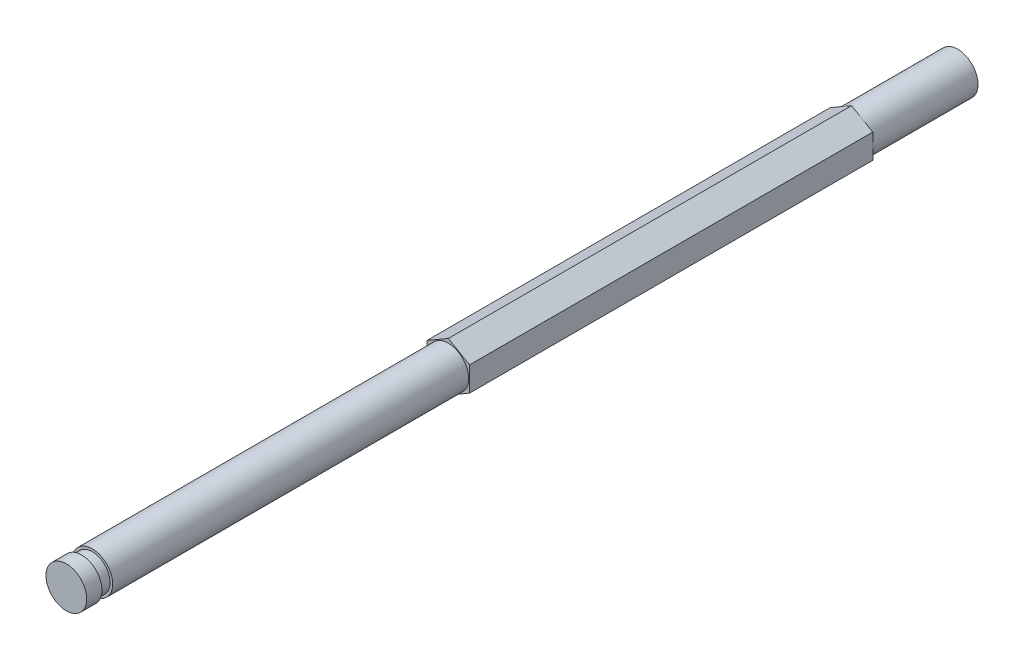
ISO-10303-21;
HEADER;
FILE_DESCRIPTION(('STEP AP214'),'2;1');
FILE_NAME('part.step','',(''),(''),'','','');
FILE_SCHEMA(('AUTOMOTIVE_DESIGN { 1 0 10303 214 1 1 1 1 }'));
ENDSEC;
DATA;
#1=APPLICATION_CONTEXT('core data for automotive mechanical design processes');
#2=APPLICATION_PROTOCOL_DEFINITION('international standard','automotive_design',2000,#1);
#3=PRODUCT_CONTEXT('',#1,'mechanical');
#4=PRODUCT('Part','Part','',(#3));
#5=PRODUCT_RELATED_PRODUCT_CATEGORY('part','',(#4));
#6=PRODUCT_DEFINITION_FORMATION('','',#4);
#7=PRODUCT_DEFINITION_CONTEXT('part definition',#1,'design');
#8=PRODUCT_DEFINITION('design','',#6,#7);
#9=PRODUCT_DEFINITION_SHAPE('','',#8);
#10=(LENGTH_UNIT() NAMED_UNIT(*) SI_UNIT(.MILLI.,.METRE.));
#11=(NAMED_UNIT(*) PLANE_ANGLE_UNIT() SI_UNIT($,.RADIAN.));
#12=(NAMED_UNIT(*) SI_UNIT($,.STERADIAN.) SOLID_ANGLE_UNIT());
#13=UNCERTAINTY_MEASURE_WITH_UNIT(LENGTH_MEASURE(1.E-05),#10,'distance_accuracy_value','');
#14=(GEOMETRIC_REPRESENTATION_CONTEXT(3) GLOBAL_UNCERTAINTY_ASSIGNED_CONTEXT((#13)) GLOBAL_UNIT_ASSIGNED_CONTEXT((#10,
#11,#12)) REPRESENTATION_CONTEXT('',''));
#15=CARTESIAN_POINT('',(0.,0.,0.));
#16=DIRECTION('',(0.,0.,1.));
#17=DIRECTION('',(1.,0.,0.));
#18=AXIS2_PLACEMENT_3D('',#15,#16,#17);
#19=CARTESIAN_POINT('',(0.,0.,76.2));
#20=DIRECTION('',(0.,0.,1.));
#21=DIRECTION('',(1.,0.,0.));
#22=AXIS2_PLACEMENT_3D('',#19,#20,#21);
#23=CYLINDRICAL_SURFACE('',#22,3.048);
#24=CARTESIAN_POINT('',(0.,0.,76.2));
#25=DIRECTION('',(0.,0.,1.));
#26=DIRECTION('',(1.,0.,0.));
#27=AXIS2_PLACEMENT_3D('',#24,#25,#26);
#28=CIRCLE('',#27,3.048);
#29=CARTESIAN_POINT('',(3.048,0.,76.2));
#30=VERTEX_POINT('',#29);
#31=EDGE_CURVE('E149',#30,#30,#28,.T.);
#32=ORIENTED_EDGE('',*,*,#31,.T.);
#33=EDGE_LOOP('',(#32));
#34=FACE_BOUND('',#33,.T.);
#35=CARTESIAN_POINT('',(0.,0.,129.4638));
#36=DIRECTION('',(0.,0.,1.));
#37=DIRECTION('',(1.,0.,0.));
#38=AXIS2_PLACEMENT_3D('',#35,#36,#37);
#39=CIRCLE('',#38,3.048);
#40=CARTESIAN_POINT('',(3.048,0.,129.4638));
#41=VERTEX_POINT('',#40);
#42=EDGE_CURVE('E41',#41,#41,#39,.F.);
#43=ORIENTED_EDGE('',*,*,#42,.T.);
#44=EDGE_LOOP('',(#43));
#45=FACE_BOUND('',#44,.T.);
#46=ADVANCED_FACE('F37',(#34,#45),#23,.T.);
#47=CARTESIAN_POINT('',(3.175,1.83308710467706,133.35));
#48=DIRECTION('',(-0.5,-0.866025403784439,0.));
#49=DIRECTION('',(0.866025403784439,-0.5,0.));
#50=AXIS2_PLACEMENT_3D('',#47,#48,#49);
#51=PLANE('',#50);
#52=DIRECTION('',(0.866025403784439,-0.5,0.));
#53=VECTOR('',#52,1.);
#54=CARTESIAN_POINT('',(3.175,1.83308710467706,15.875));
#55=LINE('',#54,#53);
#56=CARTESIAN_POINT('',(0.,3.66617420935412,15.875));
#57=VERTEX_POINT('',#56);
#58=CARTESIAN_POINT('',(3.175,1.83308710467706,15.875));
#59=VERTEX_POINT('',#58);
#60=EDGE_CURVE('E53',#57,#59,#55,.T.);
#61=ORIENTED_EDGE('',*,*,#60,.F.);
#62=DIRECTION('',(0.,0.,-1.));
#63=VECTOR('',#62,1.);
#64=CARTESIAN_POINT('',(0.,3.66617420935412,133.35));
#65=LINE('',#64,#63);
#66=CARTESIAN_POINT('',(0.,3.66617420935412,76.2));
#67=VERTEX_POINT('',#66);
#68=EDGE_CURVE('E120',#67,#57,#65,.T.);
#69=ORIENTED_EDGE('',*,*,#68,.F.);
#70=DIRECTION('',(-0.866025403784439,0.5,0.));
#71=VECTOR('',#70,1.);
#72=CARTESIAN_POINT('',(3.175,1.83308710467706,76.2));
#73=LINE('',#72,#71);
#74=CARTESIAN_POINT('',(3.175,1.83308710467706,76.2));
#75=VERTEX_POINT('',#74);
#76=EDGE_CURVE('E111',#75,#67,#73,.T.);
#77=ORIENTED_EDGE('',*,*,#76,.F.);
#78=DIRECTION('',(0.,0.,-1.));
#79=VECTOR('',#78,1.);
#80=CARTESIAN_POINT('',(3.175,1.83308710467706,133.35));
#81=LINE('',#80,#79);
#82=EDGE_CURVE('E107',#75,#59,#81,.T.);
#83=ORIENTED_EDGE('',*,*,#82,.T.);
#84=EDGE_LOOP('',(#61,#69,#77,#83));
#85=FACE_BOUND('',#84,.T.);
#86=ADVANCED_FACE('F39',(#85),#51,.F.);
#87=CARTESIAN_POINT('',(0.,3.66617420935412,133.35));
#88=DIRECTION('',(0.5,-0.866025403784439,0.));
#89=DIRECTION('',(0.866025403784439,0.5,0.));
#90=AXIS2_PLACEMENT_3D('',#87,#88,#89);
#91=PLANE('',#90);
#92=DIRECTION('',(0.866025403784439,0.5,0.));
#93=VECTOR('',#92,1.);
#94=CARTESIAN_POINT('',(0.,3.66617420935412,15.875));
#95=LINE('',#94,#93);
#96=CARTESIAN_POINT('',(-3.175,1.83308710467706,15.875));
#97=VERTEX_POINT('',#96);
#98=EDGE_CURVE('E145',#97,#57,#95,.T.);
#99=ORIENTED_EDGE('',*,*,#98,.F.);
#100=DIRECTION('',(0.,0.,-1.));
#101=VECTOR('',#100,1.);
#102=CARTESIAN_POINT('',(-3.175,1.83308710467706,133.35));
#103=LINE('',#102,#101);
#104=CARTESIAN_POINT('',(-3.175,1.83308710467706,76.2));
#105=VERTEX_POINT('',#104);
#106=EDGE_CURVE('E117',#105,#97,#103,.T.);
#107=ORIENTED_EDGE('',*,*,#106,.F.);
#108=DIRECTION('',(-0.866025403784439,-0.5,0.));
#109=VECTOR('',#108,1.);
#110=CARTESIAN_POINT('',(0.,3.66617420935412,76.2));
#111=LINE('',#110,#109);
#112=EDGE_CURVE('E159',#67,#105,#111,.T.);
#113=ORIENTED_EDGE('',*,*,#112,.F.);
#114=ORIENTED_EDGE('',*,*,#68,.T.);
#115=EDGE_LOOP('',(#99,#107,#113,#114));
#116=FACE_BOUND('',#115,.T.);
#117=ADVANCED_FACE('F169',(#116),#91,.F.);
#118=CARTESIAN_POINT('',(-3.175,1.83308710467706,133.35));
#119=DIRECTION('',(1.,0.,0.));
#120=DIRECTION('',(0.,1.,0.));
#121=AXIS2_PLACEMENT_3D('',#118,#119,#120);
#122=PLANE('',#121);
#123=DIRECTION('',(0.,1.,0.));
#124=VECTOR('',#123,1.);
#125=CARTESIAN_POINT('',(-3.175,1.83308710467706,15.875));
#126=LINE('',#125,#124);
#127=CARTESIAN_POINT('',(-3.175,-1.83308710467706,15.875));
#128=VERTEX_POINT('',#127);
#129=EDGE_CURVE('E143',#128,#97,#126,.T.);
#130=ORIENTED_EDGE('',*,*,#129,.F.);
#131=DIRECTION('',(0.,0.,-1.));
#132=VECTOR('',#131,1.);
#133=CARTESIAN_POINT('',(-3.175,-1.83308710467706,133.35));
#134=LINE('',#133,#132);
#135=CARTESIAN_POINT('',(-3.175,-1.83308710467706,76.2));
#136=VERTEX_POINT('',#135);
#137=EDGE_CURVE('E109',#136,#128,#134,.T.);
#138=ORIENTED_EDGE('',*,*,#137,.F.);
#139=DIRECTION('',(0.,-1.,0.));
#140=VECTOR('',#139,1.);
#141=CARTESIAN_POINT('',(-3.175,1.83308710467706,76.2));
#142=LINE('',#141,#140);
#143=EDGE_CURVE('E157',#105,#136,#142,.T.);
#144=ORIENTED_EDGE('',*,*,#143,.F.);
#145=ORIENTED_EDGE('',*,*,#106,.T.);
#146=EDGE_LOOP('',(#130,#138,#144,#145));
#147=FACE_BOUND('',#146,.T.);
#148=ADVANCED_FACE('F175',(#147),#122,.F.);
#149=CARTESIAN_POINT('',(-3.175,-1.83308710467706,133.35));
#150=DIRECTION('',(0.5,0.866025403784439,0.));
#151=DIRECTION('',(-0.866025403784439,0.5,0.));
#152=AXIS2_PLACEMENT_3D('',#149,#150,#151);
#153=PLANE('',#152);
#154=DIRECTION('',(-0.866025403784439,0.5,0.));
#155=VECTOR('',#154,1.);
#156=CARTESIAN_POINT('',(-3.175,-1.83308710467706,15.875));
#157=LINE('',#156,#155);
#158=CARTESIAN_POINT('',(0.,-3.66617420935412,15.875));
#159=VERTEX_POINT('',#158);
#160=EDGE_CURVE('E103',#159,#128,#157,.T.);
#161=ORIENTED_EDGE('',*,*,#160,.F.);
#162=DIRECTION('',(0.,0.,-1.));
#163=VECTOR('',#162,1.);
#164=CARTESIAN_POINT('',(0.,-3.66617420935412,133.35));
#165=LINE('',#164,#163);
#166=CARTESIAN_POINT('',(0.,-3.66617420935412,76.2));
#167=VERTEX_POINT('',#166);
#168=EDGE_CURVE('E102',#167,#159,#165,.T.);
#169=ORIENTED_EDGE('',*,*,#168,.F.);
#170=DIRECTION('',(0.866025403784439,-0.5,0.));
#171=VECTOR('',#170,1.);
#172=CARTESIAN_POINT('',(-3.175,-1.83308710467706,76.2));
#173=LINE('',#172,#171);
#174=EDGE_CURVE('E155',#136,#167,#173,.T.);
#175=ORIENTED_EDGE('',*,*,#174,.F.);
#176=ORIENTED_EDGE('',*,*,#137,.T.);
#177=EDGE_LOOP('',(#161,#169,#175,#176));
#178=FACE_BOUND('',#177,.T.);
#179=ADVANCED_FACE('F211',(#178),#153,.F.);
#180=CARTESIAN_POINT('',(0.,-3.66617420935412,133.35));
#181=DIRECTION('',(-0.5,0.866025403784439,0.));
#182=DIRECTION('',(-0.866025403784439,-0.5,0.));
#183=AXIS2_PLACEMENT_3D('',#180,#181,#182);
#184=PLANE('',#183);
#185=DIRECTION('',(-0.866025403784439,-0.5,0.));
#186=VECTOR('',#185,1.);
#187=CARTESIAN_POINT('',(0.,-3.66617420935412,15.875));
#188=LINE('',#187,#186);
#189=CARTESIAN_POINT('',(3.175,-1.83308710467706,15.875));
#190=VERTEX_POINT('',#189);
#191=EDGE_CURVE('E90',#190,#159,#188,.T.);
#192=ORIENTED_EDGE('',*,*,#191,.F.);
#193=DIRECTION('',(0.,0.,-1.));
#194=VECTOR('',#193,1.);
#195=CARTESIAN_POINT('',(3.175,-1.83308710467706,133.35));
#196=LINE('',#195,#194);
#197=CARTESIAN_POINT('',(3.175,-1.83308710467706,76.2));
#198=VERTEX_POINT('',#197);
#199=EDGE_CURVE('E100',#198,#190,#196,.T.);
#200=ORIENTED_EDGE('',*,*,#199,.F.);
#201=DIRECTION('',(0.866025403784439,0.5,0.));
#202=VECTOR('',#201,1.);
#203=CARTESIAN_POINT('',(0.,-3.66617420935412,76.2));
#204=LINE('',#203,#202);
#205=EDGE_CURVE('E61',#167,#198,#204,.T.);
#206=ORIENTED_EDGE('',*,*,#205,.F.);
#207=ORIENTED_EDGE('',*,*,#168,.T.);
#208=EDGE_LOOP('',(#192,#200,#206,#207));
#209=FACE_BOUND('',#208,.T.);
#210=ADVANCED_FACE('F99',(#209),#184,.F.);
#211=CARTESIAN_POINT('',(3.175,-1.83308710467706,133.35));
#212=DIRECTION('',(-1.,0.,0.));
#213=DIRECTION('',(0.,-1.,0.));
#214=AXIS2_PLACEMENT_3D('',#211,#212,#213);
#215=PLANE('',#214);
#216=DIRECTION('',(0.,-1.,0.));
#217=VECTOR('',#216,1.);
#218=CARTESIAN_POINT('',(3.175,-1.83308710467706,15.875));
#219=LINE('',#218,#217);
#220=EDGE_CURVE('E12',#59,#190,#219,.T.);
#221=ORIENTED_EDGE('',*,*,#220,.F.);
#222=ORIENTED_EDGE('',*,*,#82,.F.);
#223=DIRECTION('',(0.,1.,0.));
#224=VECTOR('',#223,1.);
#225=CARTESIAN_POINT('',(3.175,-1.83308710467706,76.2));
#226=LINE('',#225,#224);
#227=EDGE_CURVE('E46',#198,#75,#226,.T.);
#228=ORIENTED_EDGE('',*,*,#227,.F.);
#229=ORIENTED_EDGE('',*,*,#199,.T.);
#230=EDGE_LOOP('',(#221,#222,#228,#229));
#231=FACE_BOUND('',#230,.T.);
#232=ADVANCED_FACE('F106',(#231),#215,.F.);
#233=CARTESIAN_POINT('',(0.,0.,76.2));
#234=DIRECTION('',(0.,0.,1.));
#235=DIRECTION('',(1.,0.,0.));
#236=AXIS2_PLACEMENT_3D('',#233,#234,#235);
#237=PLANE('',#236);
#238=ORIENTED_EDGE('',*,*,#31,.F.);
#239=EDGE_LOOP('',(#238));
#240=FACE_BOUND('',#239,.T.);
#241=ORIENTED_EDGE('',*,*,#76,.T.);
#242=ORIENTED_EDGE('',*,*,#112,.T.);
#243=ORIENTED_EDGE('',*,*,#143,.T.);
#244=ORIENTED_EDGE('',*,*,#174,.T.);
#245=ORIENTED_EDGE('',*,*,#205,.T.);
#246=ORIENTED_EDGE('',*,*,#227,.T.);
#247=EDGE_LOOP('',(#241,#242,#243,#244,#245,#246));
#248=FACE_BOUND('',#247,.T.);
#249=ADVANCED_FACE('F162',(#240,#248),#237,.T.);
#250=CARTESIAN_POINT('',(0.,0.,15.875));
#251=DIRECTION('',(0.,0.,-1.));
#252=DIRECTION('',(-1.,0.,0.));
#253=AXIS2_PLACEMENT_3D('',#250,#251,#252);
#254=PLANE('',#253);
#255=CARTESIAN_POINT('',(0.,0.,15.875));
#256=DIRECTION('',(0.,0.,-1.));
#257=DIRECTION('',(-1.,0.,0.));
#258=AXIS2_PLACEMENT_3D('',#255,#256,#257);
#259=CIRCLE('',#258,3.048);
#260=CARTESIAN_POINT('',(-3.048,0.,15.875));
#261=VERTEX_POINT('',#260);
#262=EDGE_CURVE('E104',#261,#261,#259,.T.);
#263=ORIENTED_EDGE('',*,*,#262,.F.);
#264=EDGE_LOOP('',(#263));
#265=FACE_BOUND('',#264,.T.);
#266=ORIENTED_EDGE('',*,*,#60,.T.);
#267=ORIENTED_EDGE('',*,*,#220,.T.);
#268=ORIENTED_EDGE('',*,*,#191,.T.);
#269=ORIENTED_EDGE('',*,*,#160,.T.);
#270=ORIENTED_EDGE('',*,*,#129,.T.);
#271=ORIENTED_EDGE('',*,*,#98,.T.);
#272=EDGE_LOOP('',(#266,#267,#268,#269,#270,#271));
#273=FACE_BOUND('',#272,.T.);
#274=ADVANCED_FACE('F89',(#265,#273),#254,.T.);
#275=CARTESIAN_POINT('',(0.,0.,15.875));
#276=DIRECTION('',(0.,0.,-1.));
#277=DIRECTION('',(-1.,0.,0.));
#278=AXIS2_PLACEMENT_3D('',#275,#276,#277);
#279=CYLINDRICAL_SURFACE('',#278,3.048);
#280=ORIENTED_EDGE('',*,*,#262,.T.);
#281=EDGE_LOOP('',(#280));
#282=FACE_BOUND('',#281,.T.);
#283=CARTESIAN_POINT('',(0.,0.,0.));
#284=DIRECTION('',(0.,0.,-1.));
#285=DIRECTION('',(-1.,0.,0.));
#286=AXIS2_PLACEMENT_3D('',#283,#284,#285);
#287=CIRCLE('',#286,3.048);
#288=CARTESIAN_POINT('',(-3.048,0.,0.));
#289=VERTEX_POINT('',#288);
#290=EDGE_CURVE('E129',#289,#289,#287,.T.);
#291=ORIENTED_EDGE('',*,*,#290,.F.);
#292=EDGE_LOOP('',(#291));
#293=FACE_BOUND('',#292,.T.);
#294=ADVANCED_FACE('F205',(#282,#293),#279,.T.);
#295=CARTESIAN_POINT('',(0.,0.,0.));
#296=DIRECTION('',(0.,0.,1.));
#297=DIRECTION('',(1.,0.,0.));
#298=AXIS2_PLACEMENT_3D('',#295,#296,#297);
#299=PLANE('',#298);
#300=ORIENTED_EDGE('',*,*,#290,.T.);
#301=EDGE_LOOP('',(#300));
#302=FACE_BOUND('',#301,.T.);
#303=ADVANCED_FACE('F201',(#302),#299,.F.);
#304=CARTESIAN_POINT('',(0.,0.,129.4638));
#305=DIRECTION('',(0.,0.,1.));
#306=DIRECTION('',(1.,0.,0.));
#307=AXIS2_PLACEMENT_3D('',#304,#305,#306);
#308=PLANE('',#307);
#309=ORIENTED_EDGE('',*,*,#42,.F.);
#310=EDGE_LOOP('',(#309));
#311=FACE_BOUND('',#310,.T.);
#312=CARTESIAN_POINT('',(0.,0.,129.4638));
#313=DIRECTION('',(0.,0.,1.));
#314=DIRECTION('',(1.,0.,0.));
#315=AXIS2_PLACEMENT_3D('',#312,#313,#314);
#316=CIRCLE('',#315,2.667);
#317=CARTESIAN_POINT('',(2.667,0.,129.4638));
#318=VERTEX_POINT('',#317);
#319=EDGE_CURVE('E125',#318,#318,#316,.T.);
#320=ORIENTED_EDGE('',*,*,#319,.F.);
#321=EDGE_LOOP('',(#320));
#322=FACE_BOUND('',#321,.T.);
#323=ADVANCED_FACE('F204',(#311,#322),#308,.T.);
#324=CARTESIAN_POINT('',(0.,0.,131.064));
#325=DIRECTION('',(0.,0.,1.));
#326=DIRECTION('',(1.,0.,0.));
#327=AXIS2_PLACEMENT_3D('',#324,#325,#326);
#328=PLANE('',#327);
#329=CARTESIAN_POINT('',(0.,0.,131.064));
#330=DIRECTION('',(0.,0.,1.));
#331=DIRECTION('',(1.,0.,0.));
#332=AXIS2_PLACEMENT_3D('',#329,#330,#331);
#333=CIRCLE('',#332,3.048);
#334=CARTESIAN_POINT('',(3.048,0.,131.064));
#335=VERTEX_POINT('',#334);
#336=EDGE_CURVE('E123',#335,#335,#333,.F.);
#337=ORIENTED_EDGE('',*,*,#336,.T.);
#338=EDGE_LOOP('',(#337));
#339=FACE_BOUND('',#338,.T.);
#340=CARTESIAN_POINT('',(0.,0.,131.064));
#341=DIRECTION('',(0.,0.,1.));
#342=DIRECTION('',(1.,0.,0.));
#343=AXIS2_PLACEMENT_3D('',#340,#341,#342);
#344=CIRCLE('',#343,2.667);
#345=CARTESIAN_POINT('',(2.667,0.,131.064));
#346=VERTEX_POINT('',#345);
#347=EDGE_CURVE('E131',#346,#346,#344,.T.);
#348=ORIENTED_EDGE('',*,*,#347,.T.);
#349=EDGE_LOOP('',(#348));
#350=FACE_BOUND('',#349,.T.);
#351=ADVANCED_FACE('F198',(#339,#350),#328,.F.);
#352=CARTESIAN_POINT('',(0.,0.,129.4638));
#353=DIRECTION('',(0.,0.,1.));
#354=DIRECTION('',(1.,0.,0.));
#355=AXIS2_PLACEMENT_3D('',#352,#353,#354);
#356=CYLINDRICAL_SURFACE('',#355,2.667);
#357=ORIENTED_EDGE('',*,*,#319,.T.);
#358=EDGE_LOOP('',(#357));
#359=FACE_BOUND('',#358,.T.);
#360=ORIENTED_EDGE('',*,*,#347,.F.);
#361=EDGE_LOOP('',(#360));
#362=FACE_BOUND('',#361,.T.);
#363=ADVANCED_FACE('F190',(#359,#362),#356,.T.);
#364=CARTESIAN_POINT('',(0.,0.,133.35));
#365=DIRECTION('',(0.,0.,1.));
#366=DIRECTION('',(1.,0.,0.));
#367=AXIS2_PLACEMENT_3D('',#364,#365,#366);
#368=PLANE('',#367);
#369=CARTESIAN_POINT('',(0.,0.,133.35));
#370=DIRECTION('',(0.,0.,1.));
#371=DIRECTION('',(1.,0.,0.));
#372=AXIS2_PLACEMENT_3D('',#369,#370,#371);
#373=CIRCLE('',#372,3.048);
#374=CARTESIAN_POINT('',(3.048,0.,133.35));
#375=VERTEX_POINT('',#374);
#376=EDGE_CURVE('E148',#375,#375,#373,.T.);
#377=ORIENTED_EDGE('',*,*,#376,.T.);
#378=EDGE_LOOP('',(#377));
#379=FACE_BOUND('',#378,.T.);
#380=ADVANCED_FACE('F185',(#379),#368,.T.);
#381=ORIENTED_EDGE('',*,*,#336,.F.);
#382=EDGE_LOOP('',(#381));
#383=FACE_BOUND('',#382,.T.);
#384=ORIENTED_EDGE('',*,*,#376,.F.);
#385=EDGE_LOOP('',(#384));
#386=FACE_BOUND('',#385,.T.);
#387=ADVANCED_FACE('F178',(#383,#386),#23,.T.);
#388=CLOSED_SHELL('',(#46,#86,#117,#148,#179,#210,#232,#249,#274,#294,#303,#323,#351,#363,#380,#387));
#389=MANIFOLD_SOLID_BREP('B2',#388);
#390=ADVANCED_BREP_SHAPE_REPRESENTATION('',(#18,#389),#14);
#391=SHAPE_DEFINITION_REPRESENTATION(#9,#390);
ENDSEC;
END-ISO-10303-21;
